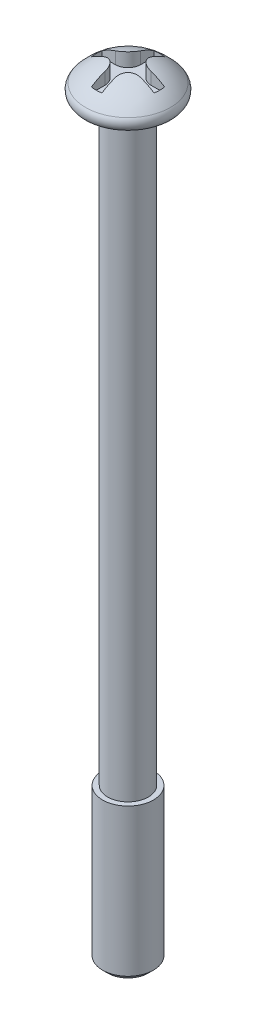
ISO-10303-21;
HEADER;
FILE_DESCRIPTION(('STEP AP214'),'2;1');
FILE_NAME('part.step','',(''),(''),'','','');
FILE_SCHEMA(('AUTOMOTIVE_DESIGN { 1 0 10303 214 1 1 1 1 }'));
ENDSEC;
DATA;
#1=APPLICATION_CONTEXT('core data for automotive mechanical design processes');
#2=APPLICATION_PROTOCOL_DEFINITION('international standard','automotive_design',2000,#1);
#3=PRODUCT_CONTEXT('',#1,'mechanical');
#4=PRODUCT('Part','Part','',(#3));
#5=PRODUCT_RELATED_PRODUCT_CATEGORY('part','',(#4));
#6=PRODUCT_DEFINITION_FORMATION('','',#4);
#7=PRODUCT_DEFINITION_CONTEXT('part definition',#1,'design');
#8=PRODUCT_DEFINITION('design','',#6,#7);
#9=PRODUCT_DEFINITION_SHAPE('','',#8);
#10=(LENGTH_UNIT() NAMED_UNIT(*) SI_UNIT(.MILLI.,.METRE.));
#11=(NAMED_UNIT(*) PLANE_ANGLE_UNIT() SI_UNIT($,.RADIAN.));
#12=(NAMED_UNIT(*) SI_UNIT($,.STERADIAN.) SOLID_ANGLE_UNIT());
#13=UNCERTAINTY_MEASURE_WITH_UNIT(LENGTH_MEASURE(1.E-05),#10,'distance_accuracy_value','');
#14=(GEOMETRIC_REPRESENTATION_CONTEXT(3) GLOBAL_UNCERTAINTY_ASSIGNED_CONTEXT((#13)) GLOBAL_UNIT_ASSIGNED_CONTEXT((#10,
#11,#12)) REPRESENTATION_CONTEXT('',''));
#15=CARTESIAN_POINT('',(0.,0.,0.));
#16=DIRECTION('',(0.,0.,1.));
#17=DIRECTION('',(1.,0.,0.));
#18=AXIS2_PLACEMENT_3D('',#15,#16,#17);
#19=CARTESIAN_POINT('',(0.,0.6,0.));
#20=DIRECTION('',(0.,-1.,0.));
#21=DIRECTION('',(0.,0.,-1.));
#22=AXIS2_PLACEMENT_3D('',#19,#20,#21);
#23=PLANE('',#22);
#24=DIRECTION('',(0.,0.,1.));
#25=VECTOR('',#24,1.);
#26=CARTESIAN_POINT('',(-0.2071067811865,0.6,1.232723318992));
#27=LINE('',#26,#25);
#28=CARTESIAN_POINT('',(-0.2071067811865,0.6,0.7071067811865));
#29=VERTEX_POINT('',#28);
#30=CARTESIAN_POINT('',(-0.2071067811865,0.6,1.23272331899198));
#31=VERTEX_POINT('',#30);
#32=EDGE_CURVE('E160',#29,#31,#27,.T.);
#33=ORIENTED_EDGE('',*,*,#32,.T.);
#34=CARTESIAN_POINT('',(0.,0.6,0.));
#35=DIRECTION('',(0.,-1.,0.));
#36=DIRECTION('',(0.,0.,-1.));
#37=AXIS2_PLACEMENT_3D('',#34,#35,#36);
#38=CIRCLE('',#37,1.25);
#39=CARTESIAN_POINT('',(0.207106781186497,0.6,1.23272331899197));
#40=VERTEX_POINT('',#39);
#41=EDGE_CURVE('E244',#31,#40,#38,.F.);
#42=ORIENTED_EDGE('',*,*,#41,.T.);
#43=DIRECTION('',(0.,0.,-1.));
#44=VECTOR('',#43,1.);
#45=CARTESIAN_POINT('',(0.2071067811865,0.6,0.7071067811865));
#46=LINE('',#45,#44);
#47=CARTESIAN_POINT('',(0.2071067811865,0.6,0.7071067811865));
#48=VERTEX_POINT('',#47);
#49=EDGE_CURVE('E164',#40,#48,#46,.T.);
#50=ORIENTED_EDGE('',*,*,#49,.T.);
#51=CARTESIAN_POINT('',(0.7071067811865,0.6,0.7071067811865));
#52=DIRECTION('',(0.,-1.,0.));
#53=DIRECTION('',(0.,0.,-1.));
#54=AXIS2_PLACEMENT_3D('',#51,#52,#53);
#55=CIRCLE('',#54,0.5);
#56=CARTESIAN_POINT('',(0.7071067811865,0.6,0.2071067811865));
#57=VERTEX_POINT('',#56);
#58=EDGE_CURVE('E167',#57,#48,#55,.F.);
#59=ORIENTED_EDGE('',*,*,#58,.F.);
#60=DIRECTION('',(1.,0.,0.));
#61=VECTOR('',#60,1.);
#62=CARTESIAN_POINT('',(1.232723318992,0.6,0.2071067811865));
#63=LINE('',#62,#61);
#64=CARTESIAN_POINT('',(1.23272331899198,0.6,0.2071067811865));
#65=VERTEX_POINT('',#64);
#66=EDGE_CURVE('E168',#57,#65,#63,.T.);
#67=ORIENTED_EDGE('',*,*,#66,.T.);
#68=CARTESIAN_POINT('',(0.,0.6,0.));
#69=DIRECTION('',(0.,-1.,0.));
#70=DIRECTION('',(0.,0.,-1.));
#71=AXIS2_PLACEMENT_3D('',#68,#69,#70);
#72=CIRCLE('',#71,1.25);
#73=CARTESIAN_POINT('',(1.23272331899197,0.6,-0.207106781186497));
#74=VERTEX_POINT('',#73);
#75=EDGE_CURVE('E255',#65,#74,#72,.F.);
#76=ORIENTED_EDGE('',*,*,#75,.T.);
#77=DIRECTION('',(-1.,0.,0.));
#78=VECTOR('',#77,1.);
#79=CARTESIAN_POINT('',(0.7071067811865,0.6,-0.2071067811865));
#80=LINE('',#79,#78);
#81=CARTESIAN_POINT('',(0.7071067811865,0.6,-0.2071067811865));
#82=VERTEX_POINT('',#81);
#83=EDGE_CURVE('E173',#74,#82,#80,.T.);
#84=ORIENTED_EDGE('',*,*,#83,.T.);
#85=CARTESIAN_POINT('',(0.7071067811865,0.6,-0.7071067811865));
#86=DIRECTION('',(0.,-1.,0.));
#87=DIRECTION('',(0.,0.,-1.));
#88=AXIS2_PLACEMENT_3D('',#85,#86,#87);
#89=CIRCLE('',#88,0.5);
#90=CARTESIAN_POINT('',(0.2071067811865,0.6,-0.7071067811865));
#91=VERTEX_POINT('',#90);
#92=EDGE_CURVE('E176',#91,#82,#89,.F.);
#93=ORIENTED_EDGE('',*,*,#92,.F.);
#94=DIRECTION('',(0.,0.,-1.));
#95=VECTOR('',#94,1.);
#96=CARTESIAN_POINT('',(0.2071067811865,0.6,-1.232723318992));
#97=LINE('',#96,#95);
#98=CARTESIAN_POINT('',(0.2071067811865,0.6,-1.23272331899198));
#99=VERTEX_POINT('',#98);
#100=EDGE_CURVE('E178',#91,#99,#97,.T.);
#101=ORIENTED_EDGE('',*,*,#100,.T.);
#102=CARTESIAN_POINT('',(0.,0.6,0.));
#103=DIRECTION('',(0.,-1.,0.));
#104=DIRECTION('',(0.,0.,-1.));
#105=AXIS2_PLACEMENT_3D('',#102,#103,#104);
#106=CIRCLE('',#105,1.25);
#107=CARTESIAN_POINT('',(-0.207106781186498,0.6,-1.23272331899197));
#108=VERTEX_POINT('',#107);
#109=EDGE_CURVE('E136',#99,#108,#106,.F.);
#110=ORIENTED_EDGE('',*,*,#109,.T.);
#111=DIRECTION('',(0.,0.,1.));
#112=VECTOR('',#111,1.);
#113=CARTESIAN_POINT('',(-0.2071067811865,0.6,-0.7071067811865));
#114=LINE('',#113,#112);
#115=CARTESIAN_POINT('',(-0.2071067811865,0.6,-0.7071067811865));
#116=VERTEX_POINT('',#115);
#117=EDGE_CURVE('E132',#108,#116,#114,.T.);
#118=ORIENTED_EDGE('',*,*,#117,.T.);
#119=CARTESIAN_POINT('',(-0.7071067811865,0.6,-0.7071067811865));
#120=DIRECTION('',(0.,-1.,0.));
#121=DIRECTION('',(0.,0.,-1.));
#122=AXIS2_PLACEMENT_3D('',#119,#120,#121);
#123=CIRCLE('',#122,0.5);
#124=CARTESIAN_POINT('',(-0.7071067811865,0.6,-0.2071067811865));
#125=VERTEX_POINT('',#124);
#126=EDGE_CURVE('E19',#125,#116,#123,.F.);
#127=ORIENTED_EDGE('',*,*,#126,.F.);
#128=DIRECTION('',(-1.,0.,0.));
#129=VECTOR('',#128,1.);
#130=CARTESIAN_POINT('',(-1.232723318992,0.6,-0.2071067811865));
#131=LINE('',#130,#129);
#132=CARTESIAN_POINT('',(-1.23272331899197,0.6,-0.207106781186497));
#133=VERTEX_POINT('',#132);
#134=EDGE_CURVE('E127',#125,#133,#131,.T.);
#135=ORIENTED_EDGE('',*,*,#134,.T.);
#136=CARTESIAN_POINT('',(0.,0.6,0.));
#137=DIRECTION('',(0.,-1.,0.));
#138=DIRECTION('',(0.,0.,-1.));
#139=AXIS2_PLACEMENT_3D('',#136,#137,#138);
#140=CIRCLE('',#139,1.25);
#141=CARTESIAN_POINT('',(-1.23272331899198,0.6,0.2071067811865));
#142=VERTEX_POINT('',#141);
#143=EDGE_CURVE('E252',#133,#142,#140,.F.);
#144=ORIENTED_EDGE('',*,*,#143,.T.);
#145=DIRECTION('',(1.,0.,0.));
#146=VECTOR('',#145,1.);
#147=CARTESIAN_POINT('',(-0.7071067811865,0.6,0.2071067811865));
#148=LINE('',#147,#146);
#149=CARTESIAN_POINT('',(-0.7071067811865,0.6,0.2071067811865));
#150=VERTEX_POINT('',#149);
#151=EDGE_CURVE('E157',#142,#150,#148,.T.);
#152=ORIENTED_EDGE('',*,*,#151,.T.);
#153=CARTESIAN_POINT('',(-0.7071067811865,0.6,0.7071067811865));
#154=DIRECTION('',(0.,-1.,0.));
#155=DIRECTION('',(0.,0.,-1.));
#156=AXIS2_PLACEMENT_3D('',#153,#154,#155);
#157=CIRCLE('',#156,0.5);
#158=EDGE_CURVE('E238',#29,#150,#157,.F.);
#159=ORIENTED_EDGE('',*,*,#158,.F.);
#160=EDGE_LOOP('',(#33,#42,#50,#59,#67,#76,#84,#93,#101,#110,#118,#127,#135,#144,#152,#159));
#161=FACE_BOUND('',#160,.T.);
#162=ADVANCED_FACE('F16',(#161),#23,.F.);
#163=CARTESIAN_POINT('',(0.,-29.5,0.));
#164=DIRECTION('',(0.,-1.,0.));
#165=DIRECTION('',(0.,0.,-1.));
#166=AXIS2_PLACEMENT_3D('',#163,#164,#165);
#167=PLANE('',#166);
#168=CARTESIAN_POINT('',(0.,-29.4999999999845,0.));
#169=DIRECTION('',(0.,1.,0.));
#170=DIRECTION('',(0.,0.,1.));
#171=AXIS2_PLACEMENT_3D('',#168,#169,#170);
#172=CIRCLE('',#171,0.800000000026557);
#173=CARTESIAN_POINT('',(0.,-29.4999999999845,0.800000000026557));
#174=VERTEX_POINT('',#173);
#175=EDGE_CURVE('E235',#174,#174,#172,.T.);
#176=ORIENTED_EDGE('',*,*,#175,.F.);
#177=EDGE_LOOP('',(#176));
#178=FACE_BOUND('',#177,.T.);
#179=ADVANCED_FACE('F301',(#178),#167,.T.);
#180=CARTESIAN_POINT('',(-1.232723318992,0.6,-0.2071067811865));
#181=DIRECTION('',(0.,0.,-1.));
#182=DIRECTION('',(-1.,0.,0.));
#183=AXIS2_PLACEMENT_3D('',#180,#181,#182);
#184=PLANE('',#183);
#185=ORIENTED_EDGE('',*,*,#134,.F.);
#186=DIRECTION('',(0.,-1.,0.));
#187=VECTOR('',#186,1.);
#188=CARTESIAN_POINT('',(-0.7071067811865,0.6,-0.2071067811865));
#189=LINE('',#188,#187);
#190=CARTESIAN_POINT('',(-0.707106781186498,1.072946400944,-0.2071067811865));
#191=VERTEX_POINT('',#190);
#192=EDGE_CURVE('E146',#191,#125,#189,.T.);
#193=ORIENTED_EDGE('',*,*,#192,.F.);
#194=CARTESIAN_POINT('',(-1.23272331899196,0.810386699023168,-0.2071067811865));
#195=CARTESIAN_POINT('',(-1.20557091875396,0.82887587654213,-0.2071067811865));
#196=CARTESIAN_POINT('',(-1.17800202853966,0.846753291703225,-0.2071067811865));
#197=CARTESIAN_POINT('',(-1.12220017955182,0.881181384346634,-0.2071067811865));
#198=CARTESIAN_POINT('',(-1.09397031989606,0.897737085070877,-0.2071067811865));
#199=CARTESIAN_POINT('',(-1.03685453980652,0.92953512182929,-0.2071067811865));
#200=CARTESIAN_POINT('',(-1.00797004904037,0.944780025871327,-0.2071067811865));
#201=CARTESIAN_POINT('',(-0.949548383728813,0.973963230596895,-0.2071067811865));
#202=CARTESIAN_POINT('',(-0.920011209183401,0.987901531280427,-0.2071067811865));
#203=CARTESIAN_POINT('',(-0.860283187710455,1.01447013922012,-0.2071067811865));
#204=CARTESIAN_POINT('',(-0.830091146209189,1.02709776103264,-0.2071067811865));
#205=CARTESIAN_POINT('',(-0.769049428807063,1.0510361956123,-0.2071067811865));
#206=CARTESIAN_POINT('',(-0.738197597941195,1.06234151350761,-0.2071067811865));
#207=CARTESIAN_POINT('',(-0.707106781186496,1.07294640094399,-0.2071067811865));
#208=B_SPLINE_CURVE_WITH_KNOTS('',3,(#194,#195,#196,#197,#198,#199,#200,#201,#202,#203,#204,
#205,#206,#207),.UNSPECIFIED.,.F.,.F.,(4,2,2,2,2,2,4),(0.,0.0985406624340739,0.196686968259895,
0.29463639109811,0.392585813936324,0.490732119762145,0.589272782196219),.UNSPECIFIED.);
#209=CARTESIAN_POINT('',(-1.23272331899197,0.810386699023184,-0.207106781186497));
#210=VERTEX_POINT('',#209);
#211=EDGE_CURVE('E287',#210,#191,#208,.T.);
#212=ORIENTED_EDGE('',*,*,#211,.F.);
#213=DIRECTION('',(0.,-1.,0.));
#214=VECTOR('',#213,1.);
#215=CARTESIAN_POINT('',(-1.23272331899197,0.6,-0.207106781186494));
#216=LINE('',#215,#214);
#217=EDGE_CURVE('E250',#210,#133,#216,.T.);
#218=ORIENTED_EDGE('',*,*,#217,.T.);
#219=EDGE_LOOP('',(#185,#193,#212,#218));
#220=FACE_BOUND('',#219,.T.);
#221=ADVANCED_FACE('F297',(#220),#184,.F.);
#222=CARTESIAN_POINT('',(-0.7071067811865,0.6,-0.7071067811865));
#223=DIRECTION('',(0.,-1.,0.));
#224=DIRECTION('',(0.,0.,-1.));
#225=AXIS2_PLACEMENT_3D('',#222,#223,#224);
#226=CYLINDRICAL_SURFACE('',#225,0.5);
#227=DIRECTION('',(0.,1.,0.));
#228=VECTOR('',#227,1.);
#229=CARTESIAN_POINT('',(-0.2071067811865,0.6,-0.7071067811865));
#230=LINE('',#229,#228);
#231=CARTESIAN_POINT('',(-0.2071067811865,1.07294640094399,-0.7071067811865));
#232=VERTEX_POINT('',#231);
#233=EDGE_CURVE('E140',#116,#232,#230,.T.);
#234=ORIENTED_EDGE('',*,*,#233,.T.);
#235=CARTESIAN_POINT('',(-0.707106781186496,1.07294640094399,-0.2071067811865));
#236=CARTESIAN_POINT('',(-0.681032109450156,1.08184936360615,-0.207081070804154));
#237=CARTESIAN_POINT('',(-0.654692789517907,1.09007217090469,-0.209146462423067));
#238=CARTESIAN_POINT('',(-0.602189232256978,1.10494894996213,-0.217521272326538));
#239=CARTESIAN_POINT('',(-0.576025489745097,1.11159952945094,-0.223839756253361));
#240=CARTESIAN_POINT('',(-0.524628426984167,1.12309832810892,-0.240805293811514));
#241=CARTESIAN_POINT('',(-0.499397716757144,1.12794179197718,-0.251463615613742));
#242=CARTESIAN_POINT('',(-0.450815555702145,1.13561433951421,-0.27691489764956));
#243=CARTESIAN_POINT('',(-0.42746171658236,1.13844602033163,-0.291702492619723));
#244=CARTESIAN_POINT('',(-0.384547250326186,1.14189822875947,-0.324168044392469));
#245=CARTESIAN_POINT('',(-0.364853574984726,1.14262462173255,-0.341659072391159));
#246=CARTESIAN_POINT('',(-0.328471063683956,1.14214199428963,-0.379503871531294));
#247=CARTESIAN_POINT('',(-0.311781927814025,1.14093316716497,-0.399857356583008));
#248=CARTESIAN_POINT('',(-0.282299252442733,1.1366874239885,-0.442181931986336));
#249=CARTESIAN_POINT('',(-0.269409322094451,1.13370289745833,-0.464091400572117));
#250=CARTESIAN_POINT('',(-0.247169371381563,1.12605008214753,-0.50938228019127));
#251=CARTESIAN_POINT('',(-0.237822286057971,1.1213804035403,-0.532764893020356));
#252=CARTESIAN_POINT('',(-0.222515268127987,1.11029409519183,-0.581246396907824));
#253=CARTESIAN_POINT('',(-0.216699862381791,1.10381703937803,-0.606376700234224));
#254=CARTESIAN_POINT('',(-0.208987376830147,1.08941617116049,-0.656788214834921));
#255=CARTESIAN_POINT('',(-0.207084783049661,1.0814944118223,-0.682069163327835));
#256=CARTESIAN_POINT('',(-0.2071067811865,1.07294640094399,-0.707106781186496));
#257=B_SPLINE_CURVE_WITH_KNOTS('',3,(#235,#236,#237,#238,#239,#240,#241,#242,#243,#244,#245,
#246,#247,#248,#249,#250,#251,#252,#253,#254,#255,#256),.UNSPECIFIED.,.F.,.F.,(4,2,2,2,2,2,2,2,
2,2,4),(0.,0.0826173206247365,0.165411303498771,0.248421641687185,0.331324620447903,
0.409979626547998,0.488626777012635,0.565061216509943,0.641558839808856,0.721006589793719,
0.800342304257926),.UNSPECIFIED.);
#258=EDGE_CURVE('E277',#191,#232,#257,.T.);
#259=ORIENTED_EDGE('',*,*,#258,.F.);
#260=ORIENTED_EDGE('',*,*,#192,.T.);
#261=ORIENTED_EDGE('',*,*,#126,.T.);
#262=EDGE_LOOP('',(#234,#259,#260,#261));
#263=FACE_BOUND('',#262,.T.);
#264=ADVANCED_FACE('F143',(#263),#226,.T.);
#265=CARTESIAN_POINT('',(-0.2071067811865,0.6,-0.7071067811865));
#266=DIRECTION('',(-1.,0.,0.));
#267=DIRECTION('',(0.,0.,1.));
#268=AXIS2_PLACEMENT_3D('',#265,#266,#267);
#269=PLANE('',#268);
#270=ORIENTED_EDGE('',*,*,#117,.F.);
#271=DIRECTION('',(0.,-1.,0.));
#272=VECTOR('',#271,1.);
#273=CARTESIAN_POINT('',(-0.207106781186495,0.6,-1.23272331899197));
#274=LINE('',#273,#272);
#275=CARTESIAN_POINT('',(-0.2071067811865,0.810386699023183,-1.23272331899195));
#276=VERTEX_POINT('',#275);
#277=EDGE_CURVE('E152',#108,#276,#274,.F.);
#278=ORIENTED_EDGE('',*,*,#277,.T.);
#279=CARTESIAN_POINT('',(-0.2071067811865,-1.,0.));
#280=DIRECTION('',(-1.,0.,0.));
#281=DIRECTION('',(0.,0.,1.));
#282=AXIS2_PLACEMENT_3D('',#279,#280,#281);
#283=CIRCLE('',#282,2.19022984665687);
#284=EDGE_CURVE('E149',#232,#276,#283,.T.);
#285=ORIENTED_EDGE('',*,*,#284,.F.);
#286=ORIENTED_EDGE('',*,*,#233,.F.);
#287=EDGE_LOOP('',(#270,#278,#285,#286));
#288=FACE_BOUND('',#287,.T.);
#289=ADVANCED_FACE('F147',(#288),#269,.F.);
#290=CARTESIAN_POINT('',(0.,0.6,0.));
#291=DIRECTION('',(0.,-1.,0.));
#292=DIRECTION('',(0.,0.,-1.));
#293=AXIS2_PLACEMENT_3D('',#290,#291,#292);
#294=CYLINDRICAL_SURFACE('',#293,1.25);
#295=ORIENTED_EDGE('',*,*,#109,.F.);
#296=DIRECTION('',(0.,1.,0.));
#297=VECTOR('',#296,1.);
#298=CARTESIAN_POINT('',(0.2071067811865,0.6,-1.232723318992));
#299=LINE('',#298,#297);
#300=CARTESIAN_POINT('',(0.2071067811865,0.810386699023172,-1.23272331899197));
#301=VERTEX_POINT('',#300);
#302=EDGE_CURVE('E179',#99,#301,#299,.T.);
#303=ORIENTED_EDGE('',*,*,#302,.T.);
#304=CARTESIAN_POINT('',(0.,0.8103866990232,0.));
#305=DIRECTION('',(0.,-1.,0.));
#306=DIRECTION('',(0.,0.,-1.));
#307=AXIS2_PLACEMENT_3D('',#304,#305,#306);
#308=CIRCLE('',#307,1.25);
#309=EDGE_CURVE('E265',#276,#301,#308,.T.);
#310=ORIENTED_EDGE('',*,*,#309,.F.);
#311=ORIENTED_EDGE('',*,*,#277,.F.);
#312=EDGE_LOOP('',(#295,#303,#310,#311));
#313=FACE_BOUND('',#312,.T.);
#314=ADVANCED_FACE('F263',(#313),#294,.F.);
#315=CARTESIAN_POINT('',(0.2071067811865,0.6,-1.232723318992));
#316=DIRECTION('',(1.,0.,0.));
#317=DIRECTION('',(0.,0.,-1.));
#318=AXIS2_PLACEMENT_3D('',#315,#316,#317);
#319=PLANE('',#318);
#320=ORIENTED_EDGE('',*,*,#100,.F.);
#321=DIRECTION('',(0.,-1.,0.));
#322=VECTOR('',#321,1.);
#323=CARTESIAN_POINT('',(0.2071067811865,0.6,-0.7071067811865));
#324=LINE('',#323,#322);
#325=CARTESIAN_POINT('',(0.2071067811865,1.07294640094399,-0.7071067811865));
#326=VERTEX_POINT('',#325);
#327=EDGE_CURVE('E257',#326,#91,#324,.T.);
#328=ORIENTED_EDGE('',*,*,#327,.F.);
#329=CARTESIAN_POINT('',(0.2071067811865,-1.,0.));
#330=DIRECTION('',(-1.,0.,0.));
#331=DIRECTION('',(0.,0.,1.));
#332=AXIS2_PLACEMENT_3D('',#329,#330,#331);
#333=CIRCLE('',#332,2.19022984665687);
#334=EDGE_CURVE('E268',#301,#326,#333,.F.);
#335=ORIENTED_EDGE('',*,*,#334,.F.);
#336=ORIENTED_EDGE('',*,*,#302,.F.);
#337=EDGE_LOOP('',(#320,#328,#335,#336));
#338=FACE_BOUND('',#337,.T.);
#339=ADVANCED_FACE('F269',(#338),#319,.F.);
#340=CARTESIAN_POINT('',(0.7071067811865,0.6,-0.7071067811865));
#341=DIRECTION('',(0.,-1.,0.));
#342=DIRECTION('',(0.,0.,-1.));
#343=AXIS2_PLACEMENT_3D('',#340,#341,#342);
#344=CYLINDRICAL_SURFACE('',#343,0.5);
#345=DIRECTION('',(0.,1.,0.));
#346=VECTOR('',#345,1.);
#347=CARTESIAN_POINT('',(0.7071067811865,0.6,-0.2071067811865));
#348=LINE('',#347,#346);
#349=CARTESIAN_POINT('',(0.707106781186498,1.072946400944,-0.2071067811865));
#350=VERTEX_POINT('',#349);
#351=EDGE_CURVE('E175',#82,#350,#348,.T.);
#352=ORIENTED_EDGE('',*,*,#351,.T.);
#353=CARTESIAN_POINT('',(0.2071067811865,1.07294640094399,-0.707106781186496));
#354=CARTESIAN_POINT('',(0.207081070804154,1.08184936360616,-0.681032109450141));
#355=CARTESIAN_POINT('',(0.209146462423069,1.0900721709047,-0.654692789517877));
#356=CARTESIAN_POINT('',(0.21752127232655,1.10494894996215,-0.602189232256918));
#357=CARTESIAN_POINT('',(0.22383975625338,1.11159952945095,-0.576025489745022));
#358=CARTESIAN_POINT('',(0.240805293811553,1.12309832810894,-0.524628426984064));
#359=CARTESIAN_POINT('',(0.251463615613793,1.1279417919772,-0.499397716757028));
#360=CARTESIAN_POINT('',(0.276914897649641,1.13561433951423,-0.450815555702008));
#361=CARTESIAN_POINT('',(0.291702492619821,1.13844602033164,-0.427461716582213));
#362=CARTESIAN_POINT('',(0.324168044392593,1.14189822875948,-0.384547250326039));
#363=CARTESIAN_POINT('',(0.341659072391289,1.14262462173256,-0.364853574984587));
#364=CARTESIAN_POINT('',(0.379503871531435,1.14214199428962,-0.328471063683833));
#365=CARTESIAN_POINT('',(0.399857356583154,1.14093316716496,-0.311781927813911));
#366=CARTESIAN_POINT('',(0.442181931986491,1.13668742398848,-0.282299252442636));
#367=CARTESIAN_POINT('',(0.464091400572276,1.1337028974583,-0.269409322094362));
#368=CARTESIAN_POINT('',(0.509382280191437,1.1260500821475,-0.247169371381491));
#369=CARTESIAN_POINT('',(0.532764893020525,1.12138040354027,-0.237822286057909));
#370=CARTESIAN_POINT('',(0.581246396907969,1.11029409519179,-0.222515268127952));
#371=CARTESIAN_POINT('',(0.606376700234341,1.103817039378,-0.216699862381768));
#372=CARTESIAN_POINT('',(0.65678821483498,1.08941617116047,-0.208987376830143));
#373=CARTESIAN_POINT('',(0.682069163327864,1.08149441182229,-0.207084783049661));
#374=CARTESIAN_POINT('',(0.707106781186497,1.07294640094399,-0.2071067811865));
#375=B_SPLINE_CURVE_WITH_KNOTS('',3,(#353,#354,#355,#356,#357,#358,#359,#360,#361,#362,#363,
#364,#365,#366,#367,#368,#369,#370,#371,#372,#373,#374),.UNSPECIFIED.,.F.,.F.,(4,2,2,2,2,2,2,2,
2,2,4),(0.,0.0826173206247837,0.165411303498866,0.248421641687329,0.331324620448095,
0.409979626548186,0.488626777012818,0.565061216510127,0.641558839809039,0.721006589793811,
0.800342304257926),.UNSPECIFIED.);
#376=EDGE_CURVE('E273',#326,#350,#375,.T.);
#377=ORIENTED_EDGE('',*,*,#376,.F.);
#378=ORIENTED_EDGE('',*,*,#327,.T.);
#379=ORIENTED_EDGE('',*,*,#92,.T.);
#380=EDGE_LOOP('',(#352,#377,#378,#379));
#381=FACE_BOUND('',#380,.T.);
#382=ADVANCED_FACE('F357',(#381),#344,.T.);
#383=CARTESIAN_POINT('',(0.7071067811865,0.6,-0.2071067811865));
#384=DIRECTION('',(0.,0.,-1.));
#385=DIRECTION('',(-1.,0.,0.));
#386=AXIS2_PLACEMENT_3D('',#383,#384,#385);
#387=PLANE('',#386);
#388=ORIENTED_EDGE('',*,*,#83,.F.);
#389=DIRECTION('',(0.,-1.,0.));
#390=VECTOR('',#389,1.);
#391=CARTESIAN_POINT('',(1.23272331899197,0.6,-0.207106781186495));
#392=LINE('',#391,#390);
#393=CARTESIAN_POINT('',(1.23272331899197,0.8103866990232,-0.207106781186497));
#394=VERTEX_POINT('',#393);
#395=EDGE_CURVE('E172',#74,#394,#392,.F.);
#396=ORIENTED_EDGE('',*,*,#395,.T.);
#397=CARTESIAN_POINT('',(0.707106781186497,1.07294640094399,-0.2071067811865));
#398=CARTESIAN_POINT('',(0.738197597941195,1.06234151350761,-0.2071067811865));
#399=CARTESIAN_POINT('',(0.769049428807063,1.0510361956123,-0.2071067811865));
#400=CARTESIAN_POINT('',(0.830091146209189,1.02709776103264,-0.2071067811865));
#401=CARTESIAN_POINT('',(0.860283187710455,1.01447013922012,-0.2071067811865));
#402=CARTESIAN_POINT('',(0.920011209183402,0.987901531280427,-0.2071067811865));
#403=CARTESIAN_POINT('',(0.949548383728813,0.973963230596895,-0.2071067811865));
#404=CARTESIAN_POINT('',(1.00797004904037,0.944780025871326,-0.2071067811865));
#405=CARTESIAN_POINT('',(1.03685453980652,0.92953512182929,-0.2071067811865));
#406=CARTESIAN_POINT('',(1.09397031989606,0.897737085070877,-0.2071067811865));
#407=CARTESIAN_POINT('',(1.12220017955182,0.881181384346634,-0.2071067811865));
#408=CARTESIAN_POINT('',(1.17800202853966,0.846753291703224,-0.2071067811865));
#409=CARTESIAN_POINT('',(1.20557091875396,0.82887587654213,-0.2071067811865));
#410=CARTESIAN_POINT('',(1.23272331899196,0.810386699023168,-0.207106781186499));
#411=B_SPLINE_CURVE_WITH_KNOTS('',3,(#397,#398,#399,#400,#401,#402,#403,#404,#405,#406,#407,
#408,#409,#410),.UNSPECIFIED.,.F.,.F.,(4,2,2,2,2,2,4),(0.,0.0985406624340736,0.196686968259895,
0.294636391098109,0.392585813936324,0.490732119762145,0.589272782196219),.UNSPECIFIED.);
#412=EDGE_CURVE('E364',#350,#394,#411,.T.);
#413=ORIENTED_EDGE('',*,*,#412,.F.);
#414=ORIENTED_EDGE('',*,*,#351,.F.);
#415=EDGE_LOOP('',(#388,#396,#413,#414));
#416=FACE_BOUND('',#415,.T.);
#417=ADVANCED_FACE('F361',(#416),#387,.F.);
#418=CARTESIAN_POINT('',(0.,0.6,0.));
#419=DIRECTION('',(0.,-1.,0.));
#420=DIRECTION('',(0.,0.,-1.));
#421=AXIS2_PLACEMENT_3D('',#418,#419,#420);
#422=CYLINDRICAL_SURFACE('',#421,1.25);
#423=ORIENTED_EDGE('',*,*,#143,.F.);
#424=ORIENTED_EDGE('',*,*,#217,.F.);
#425=CARTESIAN_POINT('',(0.,0.8103866990232,0.));
#426=DIRECTION('',(0.,-1.,0.));
#427=DIRECTION('',(0.,0.,-1.));
#428=AXIS2_PLACEMENT_3D('',#425,#426,#427);
#429=CIRCLE('',#428,1.25);
#430=CARTESIAN_POINT('',(-1.23272331899198,0.8103866990232,0.2071067811865));
#431=VERTEX_POINT('',#430);
#432=EDGE_CURVE('E366',#431,#210,#429,.T.);
#433=ORIENTED_EDGE('',*,*,#432,.F.);
#434=DIRECTION('',(0.,1.,0.));
#435=VECTOR('',#434,1.);
#436=CARTESIAN_POINT('',(-1.232723318992,0.6,0.2071067811865));
#437=LINE('',#436,#435);
#438=EDGE_CURVE('E159',#431,#142,#437,.F.);
#439=ORIENTED_EDGE('',*,*,#438,.T.);
#440=EDGE_LOOP('',(#423,#424,#433,#439));
#441=FACE_BOUND('',#440,.T.);
#442=ADVANCED_FACE('F444',(#441),#422,.F.);
#443=CARTESIAN_POINT('',(0.,0.6,0.));
#444=DIRECTION('',(0.,-1.,0.));
#445=DIRECTION('',(0.,0.,-1.));
#446=AXIS2_PLACEMENT_3D('',#443,#444,#445);
#447=CYLINDRICAL_SURFACE('',#446,1.25);
#448=ORIENTED_EDGE('',*,*,#395,.F.);
#449=ORIENTED_EDGE('',*,*,#75,.F.);
#450=DIRECTION('',(0.,1.,0.));
#451=VECTOR('',#450,1.);
#452=CARTESIAN_POINT('',(1.232723318992,0.6,0.2071067811865));
#453=LINE('',#452,#451);
#454=CARTESIAN_POINT('',(1.23272331899198,0.810386699023182,0.2071067811865));
#455=VERTEX_POINT('',#454);
#456=EDGE_CURVE('E171',#65,#455,#453,.T.);
#457=ORIENTED_EDGE('',*,*,#456,.T.);
#458=CARTESIAN_POINT('',(0.,0.8103866990232,0.));
#459=DIRECTION('',(0.,-1.,0.));
#460=DIRECTION('',(0.,0.,-1.));
#461=AXIS2_PLACEMENT_3D('',#458,#459,#460);
#462=CIRCLE('',#461,1.25);
#463=EDGE_CURVE('E593',#394,#455,#462,.T.);
#464=ORIENTED_EDGE('',*,*,#463,.F.);
#465=EDGE_LOOP('',(#448,#449,#457,#464));
#466=FACE_BOUND('',#465,.T.);
#467=ADVANCED_FACE('F451',(#466),#447,.F.);
#468=CARTESIAN_POINT('',(1.232723318992,0.6,0.2071067811865));
#469=DIRECTION('',(0.,0.,1.));
#470=DIRECTION('',(1.,0.,0.));
#471=AXIS2_PLACEMENT_3D('',#468,#469,#470);
#472=PLANE('',#471);
#473=ORIENTED_EDGE('',*,*,#66,.F.);
#474=DIRECTION('',(0.,-1.,0.));
#475=VECTOR('',#474,1.);
#476=CARTESIAN_POINT('',(0.7071067811865,0.6,0.2071067811865));
#477=LINE('',#476,#475);
#478=CARTESIAN_POINT('',(0.707106781186498,1.072946400944,0.2071067811865));
#479=VERTEX_POINT('',#478);
#480=EDGE_CURVE('E246',#479,#57,#477,.T.);
#481=ORIENTED_EDGE('',*,*,#480,.F.);
#482=CARTESIAN_POINT('',(1.23272331899197,0.810386699023165,0.2071067811865));
#483=CARTESIAN_POINT('',(1.20557091875396,0.828875876542126,0.2071067811865));
#484=CARTESIAN_POINT('',(1.17800202853966,0.846753291703221,0.2071067811865));
#485=CARTESIAN_POINT('',(1.12220017955182,0.881181384346632,0.2071067811865));
#486=CARTESIAN_POINT('',(1.09397031989606,0.897737085070875,0.2071067811865));
#487=CARTESIAN_POINT('',(1.03685453980653,0.929535121829288,0.2071067811865));
#488=CARTESIAN_POINT('',(1.00797004904038,0.944780025871325,0.2071067811865));
#489=CARTESIAN_POINT('',(0.949548383728815,0.973963230596894,0.2071067811865));
#490=CARTESIAN_POINT('',(0.920011209183404,0.987901531280426,0.2071067811865));
#491=CARTESIAN_POINT('',(0.860283187710457,1.01447013922012,0.2071067811865));
#492=CARTESIAN_POINT('',(0.83009114620919,1.02709776103264,0.2071067811865));
#493=CARTESIAN_POINT('',(0.769049428807064,1.0510361956123,0.2071067811865));
#494=CARTESIAN_POINT('',(0.738197597941195,1.06234151350761,0.2071067811865));
#495=CARTESIAN_POINT('',(0.707106781186496,1.07294640094399,0.207106781186501));
#496=B_SPLINE_CURVE_WITH_KNOTS('',3,(#482,#483,#484,#485,#486,#487,#488,#489,#490,#491,#492,
#493,#494,#495),.UNSPECIFIED.,.F.,.F.,(4,2,2,2,2,2,4),(0.,0.0985406624340749,0.196686968259897,
0.294636391098113,0.392585813936328,0.49073211976215,0.589272782196225),.UNSPECIFIED.);
#497=EDGE_CURVE('E592',#455,#479,#496,.T.);
#498=ORIENTED_EDGE('',*,*,#497,.F.);
#499=ORIENTED_EDGE('',*,*,#456,.F.);
#500=EDGE_LOOP('',(#473,#481,#498,#499));
#501=FACE_BOUND('',#500,.T.);
#502=ADVANCED_FACE('F459',(#501),#472,.F.);
#503=CARTESIAN_POINT('',(0.7071067811865,0.6,0.7071067811865));
#504=DIRECTION('',(0.,-1.,0.));
#505=DIRECTION('',(0.,0.,-1.));
#506=AXIS2_PLACEMENT_3D('',#503,#504,#505);
#507=CYLINDRICAL_SURFACE('',#506,0.5);
#508=DIRECTION('',(0.,1.,0.));
#509=VECTOR('',#508,1.);
#510=CARTESIAN_POINT('',(0.2071067811865,0.6,0.7071067811865));
#511=LINE('',#510,#509);
#512=CARTESIAN_POINT('',(0.2071067811865,1.07294640094399,0.707106781186498));
#513=VERTEX_POINT('',#512);
#514=EDGE_CURVE('E166',#48,#513,#511,.T.);
#515=ORIENTED_EDGE('',*,*,#514,.T.);
#516=CARTESIAN_POINT('',(0.707106781186496,1.07294640094399,0.2071067811865));
#517=CARTESIAN_POINT('',(0.681032109450157,1.08184936360615,0.207081070804154));
#518=CARTESIAN_POINT('',(0.654692789517907,1.09007217090469,0.209146462423067));
#519=CARTESIAN_POINT('',(0.602189232256979,1.10494894996213,0.217521272326537));
#520=CARTESIAN_POINT('',(0.576025489745098,1.11159952945094,0.22383975625336));
#521=CARTESIAN_POINT('',(0.524628426984168,1.12309832810892,0.240805293811513));
#522=CARTESIAN_POINT('',(0.499397716757145,1.12794179197718,0.251463615613741));
#523=CARTESIAN_POINT('',(0.450815555702147,1.13561433951421,0.276914897649559));
#524=CARTESIAN_POINT('',(0.427461716582363,1.13844602033163,0.291702492619723));
#525=CARTESIAN_POINT('',(0.384547250326188,1.14189822875948,0.324168044392469));
#526=CARTESIAN_POINT('',(0.364853574984728,1.14262462173255,0.341659072391157));
#527=CARTESIAN_POINT('',(0.328471063683957,1.14214199428963,0.379503871531292));
#528=CARTESIAN_POINT('',(0.311781927814027,1.14093316716497,0.399857356583006));
#529=CARTESIAN_POINT('',(0.282299252442735,1.1366874239885,0.442181931986334));
#530=CARTESIAN_POINT('',(0.269409322094453,1.13370289745833,0.464091400572114));
#531=CARTESIAN_POINT('',(0.247169371381564,1.12605008214753,0.509382280191267));
#532=CARTESIAN_POINT('',(0.237822286057972,1.12138040354031,0.532764893020352));
#533=CARTESIAN_POINT('',(0.222515268127988,1.11029409519183,0.581246396907821));
#534=CARTESIAN_POINT('',(0.216699862381791,1.10381703937803,0.606376700234222));
#535=CARTESIAN_POINT('',(0.208987376830147,1.08941617116049,0.65678821483492));
#536=CARTESIAN_POINT('',(0.207084783049661,1.0814944118223,0.682069163327835));
#537=CARTESIAN_POINT('',(0.207106781186501,1.07294640094399,0.707106781186497));
#538=B_SPLINE_CURVE_WITH_KNOTS('',3,(#516,#517,#518,#519,#520,#521,#522,#523,#524,#525,#526,
#527,#528,#529,#530,#531,#532,#533,#534,#535,#536,#537),.UNSPECIFIED.,.F.,.F.,(4,2,2,2,2,2,2,2,
2,2,4),(0.,0.082617320624736,0.16541130349877,0.248421641687183,0.331324620447901,
0.409979626547996,0.488626777012632,0.56506121650994,0.641558839808852,0.721006589793717,
0.800342304257927),.UNSPECIFIED.);
#539=EDGE_CURVE('E588',#479,#513,#538,.T.);
#540=ORIENTED_EDGE('',*,*,#539,.F.);
#541=ORIENTED_EDGE('',*,*,#480,.T.);
#542=ORIENTED_EDGE('',*,*,#58,.T.);
#543=EDGE_LOOP('',(#515,#540,#541,#542));
#544=FACE_BOUND('',#543,.T.);
#545=ADVANCED_FACE('F468',(#544),#507,.T.);
#546=CARTESIAN_POINT('',(0.2071067811865,0.6,0.7071067811865));
#547=DIRECTION('',(1.,0.,0.));
#548=DIRECTION('',(0.,0.,-1.));
#549=AXIS2_PLACEMENT_3D('',#546,#547,#548);
#550=PLANE('',#549);
#551=ORIENTED_EDGE('',*,*,#49,.F.);
#552=DIRECTION('',(0.,-1.,0.));
#553=VECTOR('',#552,1.);
#554=CARTESIAN_POINT('',(0.207106781186494,0.6,1.23272331899197));
#555=LINE('',#554,#553);
#556=CARTESIAN_POINT('',(0.207106781186497,0.8103866990232,1.23272331899197));
#557=VERTEX_POINT('',#556);
#558=EDGE_CURVE('E163',#40,#557,#555,.F.);
#559=ORIENTED_EDGE('',*,*,#558,.T.);
#560=CARTESIAN_POINT('',(0.207106781186499,1.07294640094399,0.707106781186497));
#561=CARTESIAN_POINT('',(0.2071067811865,1.06234151350761,0.738197597941195));
#562=CARTESIAN_POINT('',(0.2071067811865,1.0510361956123,0.769049428807063));
#563=CARTESIAN_POINT('',(0.2071067811865,1.02709776103264,0.830091146209189));
#564=CARTESIAN_POINT('',(0.2071067811865,1.01447013922012,0.860283187710455));
#565=CARTESIAN_POINT('',(0.2071067811865,0.987901531280426,0.920011209183402));
#566=CARTESIAN_POINT('',(0.2071067811865,0.973963230596895,0.949548383728813));
#567=CARTESIAN_POINT('',(0.2071067811865,0.944780025871327,1.00797004904037));
#568=CARTESIAN_POINT('',(0.2071067811865,0.92953512182929,1.03685453980652));
#569=CARTESIAN_POINT('',(0.2071067811865,0.897737085070877,1.09397031989606));
#570=CARTESIAN_POINT('',(0.2071067811865,0.881181384346634,1.12220017955182));
#571=CARTESIAN_POINT('',(0.2071067811865,0.846753291703224,1.17800202853966));
#572=CARTESIAN_POINT('',(0.2071067811865,0.828875876542129,1.20557091875396));
#573=CARTESIAN_POINT('',(0.2071067811865,0.810386699023168,1.23272331899196));
#574=B_SPLINE_CURVE_WITH_KNOTS('',3,(#560,#561,#562,#563,#564,#565,#566,#567,#568,#569,#570,
#571,#572,#573),.UNSPECIFIED.,.F.,.F.,(4,2,2,2,2,2,4),(0.,0.0985406624340738,0.196686968259895,
0.29463639109811,0.392585813936324,0.490732119762146,0.589272782196219),.UNSPECIFIED.);
#575=EDGE_CURVE('E584',#513,#557,#574,.T.);
#576=ORIENTED_EDGE('',*,*,#575,.F.);
#577=ORIENTED_EDGE('',*,*,#514,.F.);
#578=EDGE_LOOP('',(#551,#559,#576,#577));
#579=FACE_BOUND('',#578,.T.);
#580=ADVANCED_FACE('F477',(#579),#550,.F.);
#581=CARTESIAN_POINT('',(0.,0.6,0.));
#582=DIRECTION('',(0.,-1.,0.));
#583=DIRECTION('',(0.,0.,-1.));
#584=AXIS2_PLACEMENT_3D('',#581,#582,#583);
#585=CYLINDRICAL_SURFACE('',#584,1.25);
#586=ORIENTED_EDGE('',*,*,#41,.F.);
#587=DIRECTION('',(0.,1.,0.));
#588=VECTOR('',#587,1.);
#589=CARTESIAN_POINT('',(-0.2071067811865,0.6,1.232723318992));
#590=LINE('',#589,#588);
#591=CARTESIAN_POINT('',(-0.2071067811865,0.810386699023182,1.23272331899199));
#592=VERTEX_POINT('',#591);
#593=EDGE_CURVE('E162',#31,#592,#590,.T.);
#594=ORIENTED_EDGE('',*,*,#593,.T.);
#595=CARTESIAN_POINT('',(0.,0.8103866990232,0.));
#596=DIRECTION('',(0.,-1.,0.));
#597=DIRECTION('',(0.,0.,-1.));
#598=AXIS2_PLACEMENT_3D('',#595,#596,#597);
#599=CIRCLE('',#598,1.25);
#600=EDGE_CURVE('E580',#557,#592,#599,.T.);
#601=ORIENTED_EDGE('',*,*,#600,.F.);
#602=ORIENTED_EDGE('',*,*,#558,.F.);
#603=EDGE_LOOP('',(#586,#594,#601,#602));
#604=FACE_BOUND('',#603,.T.);
#605=ADVANCED_FACE('F486',(#604),#585,.F.);
#606=CARTESIAN_POINT('',(-0.2071067811865,0.6,1.232723318992));
#607=DIRECTION('',(-1.,0.,0.));
#608=DIRECTION('',(0.,0.,1.));
#609=AXIS2_PLACEMENT_3D('',#606,#607,#608);
#610=PLANE('',#609);
#611=ORIENTED_EDGE('',*,*,#32,.F.);
#612=DIRECTION('',(0.,-1.,0.));
#613=VECTOR('',#612,1.);
#614=CARTESIAN_POINT('',(-0.2071067811865,0.6,0.7071067811865));
#615=LINE('',#614,#613);
#616=CARTESIAN_POINT('',(-0.2071067811865,1.072946400944,0.707106781186498));
#617=VERTEX_POINT('',#616);
#618=EDGE_CURVE('E239',#617,#29,#615,.T.);
#619=ORIENTED_EDGE('',*,*,#618,.F.);
#620=CARTESIAN_POINT('',(-0.2071067811865,0.810386699023165,1.23272331899197));
#621=CARTESIAN_POINT('',(-0.2071067811865,0.828875876542127,1.20557091875396));
#622=CARTESIAN_POINT('',(-0.2071067811865,0.846753291703222,1.17800202853966));
#623=CARTESIAN_POINT('',(-0.2071067811865,0.881181384346632,1.12220017955182));
#624=CARTESIAN_POINT('',(-0.2071067811865,0.897737085070875,1.09397031989606));
#625=CARTESIAN_POINT('',(-0.2071067811865,0.929535121829289,1.03685453980653));
#626=CARTESIAN_POINT('',(-0.2071067811865,0.944780025871326,1.00797004904038));
#627=CARTESIAN_POINT('',(-0.2071067811865,0.973963230596894,0.949548383728815));
#628=CARTESIAN_POINT('',(-0.2071067811865,0.987901531280426,0.920011209183403));
#629=CARTESIAN_POINT('',(-0.2071067811865,1.01447013922012,0.860283187710456));
#630=CARTESIAN_POINT('',(-0.2071067811865,1.02709776103264,0.83009114620919));
#631=CARTESIAN_POINT('',(-0.2071067811865,1.0510361956123,0.769049428807063));
#632=CARTESIAN_POINT('',(-0.2071067811865,1.06234151350761,0.738197597941195));
#633=CARTESIAN_POINT('',(-0.207106781186501,1.07294640094399,0.707106781186496));
#634=B_SPLINE_CURVE_WITH_KNOTS('',3,(#620,#621,#622,#623,#624,#625,#626,#627,#628,#629,#630,
#631,#632,#633),.UNSPECIFIED.,.F.,.F.,(4,2,2,2,2,2,4),(0.,0.0985406624340749,0.196686968259897,
0.294636391098113,0.392585813936328,0.490732119762151,0.589272782196225),.UNSPECIFIED.);
#635=EDGE_CURVE('E574',#592,#617,#634,.T.);
#636=ORIENTED_EDGE('',*,*,#635,.F.);
#637=ORIENTED_EDGE('',*,*,#593,.F.);
#638=EDGE_LOOP('',(#611,#619,#636,#637));
#639=FACE_BOUND('',#638,.T.);
#640=ADVANCED_FACE('F495',(#639),#610,.F.);
#641=CARTESIAN_POINT('',(-0.7071067811865,0.6,0.7071067811865));
#642=DIRECTION('',(0.,-1.,0.));
#643=DIRECTION('',(0.,0.,-1.));
#644=AXIS2_PLACEMENT_3D('',#641,#642,#643);
#645=CYLINDRICAL_SURFACE('',#644,0.5);
#646=DIRECTION('',(0.,1.,0.));
#647=VECTOR('',#646,1.);
#648=CARTESIAN_POINT('',(-0.7071067811865,0.6,0.2071067811865));
#649=LINE('',#648,#647);
#650=CARTESIAN_POINT('',(-0.707106781186498,1.072946400944,0.2071067811865));
#651=VERTEX_POINT('',#650);
#652=EDGE_CURVE('E34',#150,#651,#649,.T.);
#653=ORIENTED_EDGE('',*,*,#652,.T.);
#654=CARTESIAN_POINT('',(-0.2071067811865,1.07294640094399,0.707106781186497));
#655=CARTESIAN_POINT('',(-0.207081070804153,1.08184936360615,0.681032109450155));
#656=CARTESIAN_POINT('',(-0.209146462423067,1.09007217090469,0.654692789517904));
#657=CARTESIAN_POINT('',(-0.217521272326539,1.10494894996213,0.602189232256971));
#658=CARTESIAN_POINT('',(-0.223839756253363,1.11159952945094,0.576025489745088));
#659=CARTESIAN_POINT('',(-0.240805293811518,1.12309832810892,0.524628426984155));
#660=CARTESIAN_POINT('',(-0.251463615613748,1.12794179197718,0.49939771675713));
#661=CARTESIAN_POINT('',(-0.27691489764957,1.13561433951421,0.450815555702129));
#662=CARTESIAN_POINT('',(-0.291702492619735,1.13844602033163,0.427461716582343));
#663=CARTESIAN_POINT('',(-0.324168044392485,1.14189822875948,0.384547250326168));
#664=CARTESIAN_POINT('',(-0.341659072391175,1.14262462173255,0.36485357498471));
#665=CARTESIAN_POINT('',(-0.379503871531311,1.14214199428963,0.328471063683941));
#666=CARTESIAN_POINT('',(-0.399857356583025,1.14093316716497,0.311781927814011));
#667=CARTESIAN_POINT('',(-0.442181931986355,1.1366874239885,0.282299252442721));
#668=CARTESIAN_POINT('',(-0.464091400572136,1.13370289745832,0.26940932209444));
#669=CARTESIAN_POINT('',(-0.50938228019129,1.12605008214752,0.247169371381554));
#670=CARTESIAN_POINT('',(-0.532764893020376,1.1213804035403,0.237822286057964));
#671=CARTESIAN_POINT('',(-0.581246396907841,1.11029409519182,0.222515268127983));
#672=CARTESIAN_POINT('',(-0.606376700234238,1.10381703937803,0.216699862381788));
#673=CARTESIAN_POINT('',(-0.656788214834928,1.08941617116049,0.208987376830146));
#674=CARTESIAN_POINT('',(-0.682069163327838,1.0814944118223,0.207084783049661));
#675=CARTESIAN_POINT('',(-0.707106781186496,1.07294640094399,0.2071067811865));
#676=B_SPLINE_CURVE_WITH_KNOTS('',3,(#654,#655,#656,#657,#658,#659,#660,#661,#662,#663,#664,
#665,#666,#667,#668,#669,#670,#671,#672,#673,#674,#675),.UNSPECIFIED.,.F.,.F.,(4,2,2,2,2,2,2,2,
2,2,4),(0.,0.0826173206247423,0.165411303498782,0.248421641687202,0.331324620447927,
0.409979626548022,0.488626777012658,0.565061216509965,0.641558839808878,0.721006589793731,
0.800342304257926),.UNSPECIFIED.);
#677=EDGE_CURVE('E202',#617,#651,#676,.T.);
#678=ORIENTED_EDGE('',*,*,#677,.F.);
#679=ORIENTED_EDGE('',*,*,#618,.T.);
#680=ORIENTED_EDGE('',*,*,#158,.T.);
#681=EDGE_LOOP('',(#653,#678,#679,#680));
#682=FACE_BOUND('',#681,.T.);
#683=ADVANCED_FACE('F504',(#682),#645,.T.);
#684=CARTESIAN_POINT('',(-0.7071067811865,0.6,0.2071067811865));
#685=DIRECTION('',(0.,0.,1.));
#686=DIRECTION('',(1.,0.,0.));
#687=AXIS2_PLACEMENT_3D('',#684,#685,#686);
#688=PLANE('',#687);
#689=ORIENTED_EDGE('',*,*,#151,.F.);
#690=ORIENTED_EDGE('',*,*,#438,.F.);
#691=CARTESIAN_POINT('',(-0.707106781186496,1.07294640094399,0.2071067811865));
#692=CARTESIAN_POINT('',(-0.738197597941195,1.06234151350761,0.2071067811865));
#693=CARTESIAN_POINT('',(-0.769049428807064,1.0510361956123,0.2071067811865));
#694=CARTESIAN_POINT('',(-0.830091146209191,1.02709776103264,0.2071067811865));
#695=CARTESIAN_POINT('',(-0.860283187710458,1.01447013922012,0.2071067811865));
#696=CARTESIAN_POINT('',(-0.920011209183405,0.987901531280425,0.2071067811865));
#697=CARTESIAN_POINT('',(-0.949548383728818,0.973963230596893,0.2071067811865));
#698=CARTESIAN_POINT('',(-1.00797004904038,0.944780025871324,0.2071067811865));
#699=CARTESIAN_POINT('',(-1.03685453980653,0.929535121829287,0.2071067811865));
#700=CARTESIAN_POINT('',(-1.09397031989607,0.897737085070873,0.2071067811865));
#701=CARTESIAN_POINT('',(-1.12220017955182,0.88118138434663,0.2071067811865));
#702=CARTESIAN_POINT('',(-1.17800202853967,0.846753291703219,0.2071067811865));
#703=CARTESIAN_POINT('',(-1.20557091875397,0.828875876542124,0.2071067811865));
#704=CARTESIAN_POINT('',(-1.23272331899197,0.810386699023162,0.207106781186499));
#705=B_SPLINE_CURVE_WITH_KNOTS('',3,(#691,#692,#693,#694,#695,#696,#697,#698,#699,#700,#701,
#702,#703,#704),.UNSPECIFIED.,.F.,.F.,(4,2,2,2,2,2,4),(0.,0.0985406624340756,0.196686968259899,
0.294636391098115,0.392585813936332,0.490732119762155,0.58927278219623),.UNSPECIFIED.);
#706=EDGE_CURVE('E193',#651,#431,#705,.T.);
#707=ORIENTED_EDGE('',*,*,#706,.F.);
#708=ORIENTED_EDGE('',*,*,#652,.F.);
#709=EDGE_LOOP('',(#689,#690,#707,#708));
#710=FACE_BOUND('',#709,.T.);
#711=ADVANCED_FACE('F209',(#710),#688,.F.);
#712=CARTESIAN_POINT('',(0.,-29.3000000000347,0.));
#713=DIRECTION('',(0.,1.,0.));
#714=DIRECTION('',(0.,0.,1.));
#715=AXIS2_PLACEMENT_3D('',#712,#713,#714);
#716=CONICAL_SURFACE('',#715,0.999999999976353,0.785398163397448);
#717=CARTESIAN_POINT('',(0.,-29.3,0.));
#718=DIRECTION('',(0.,-1.,0.));
#719=DIRECTION('',(0.,0.,-1.));
#720=AXIS2_PLACEMENT_3D('',#717,#718,#719);
#721=CIRCLE('',#720,1.);
#722=CARTESIAN_POINT('',(0.,-29.3,-1.));
#723=VERTEX_POINT('',#722);
#724=EDGE_CURVE('E192',#723,#723,#721,.F.);
#725=ORIENTED_EDGE('',*,*,#724,.F.);
#726=EDGE_LOOP('',(#725));
#727=FACE_BOUND('',#726,.T.);
#728=ORIENTED_EDGE('',*,*,#175,.T.);
#729=EDGE_LOOP('',(#728));
#730=FACE_BOUND('',#729,.T.);
#731=ADVANCED_FACE('F219',(#727,#730),#716,.T.);
#732=CARTESIAN_POINT('',(0.,-1.,0.));
#733=DIRECTION('',(0.822903045010529,-0.56818181818182,0.));
#734=DIRECTION('',(0.,0.,-1.));
#735=AXIS2_PLACEMENT_3D('',#732,#733,#734);
#736=SPHERICAL_SURFACE('',#735,2.2);
#737=CARTESIAN_POINT('',(0.,0.432108774041665,0.));
#738=DIRECTION('',(0.,-1.,0.));
#739=DIRECTION('',(-1.,0.,0.));
#740=AXIS2_PLACEMENT_3D('',#737,#738,#739);
#741=CIRCLE('',#740,1.67004923858884);
#742=CARTESIAN_POINT('',(-1.67004923858884,0.432108774041665,0.));
#743=VERTEX_POINT('',#742);
#744=EDGE_CURVE('E189',#743,#743,#741,.T.);
#745=ORIENTED_EDGE('',*,*,#744,.F.);
#746=EDGE_LOOP('',(#745));
#747=FACE_BOUND('',#746,.T.);
#748=ORIENTED_EDGE('',*,*,#677,.T.);
#749=ORIENTED_EDGE('',*,*,#706,.T.);
#750=ORIENTED_EDGE('',*,*,#432,.T.);
#751=ORIENTED_EDGE('',*,*,#211,.T.);
#752=ORIENTED_EDGE('',*,*,#258,.T.);
#753=ORIENTED_EDGE('',*,*,#284,.T.);
#754=ORIENTED_EDGE('',*,*,#309,.T.);
#755=ORIENTED_EDGE('',*,*,#334,.T.);
#756=ORIENTED_EDGE('',*,*,#376,.T.);
#757=ORIENTED_EDGE('',*,*,#412,.T.);
#758=ORIENTED_EDGE('',*,*,#463,.T.);
#759=ORIENTED_EDGE('',*,*,#497,.T.);
#760=ORIENTED_EDGE('',*,*,#539,.T.);
#761=ORIENTED_EDGE('',*,*,#575,.T.);
#762=ORIENTED_EDGE('',*,*,#600,.T.);
#763=ORIENTED_EDGE('',*,*,#635,.T.);
#764=EDGE_LOOP('',(#748,#749,#750,#751,#752,#753,#754,#755,#756,#757,#758,#759,#760,#761,#762,#763));
#765=FACE_BOUND('',#764,.T.);
#766=ADVANCED_FACE('F212',(#747,#765),#736,.T.);
#767=CARTESIAN_POINT('',(0.,2.735,0.));
#768=DIRECTION('',(0.,-1.,0.));
#769=DIRECTION('',(0.,0.,-1.));
#770=AXIS2_PLACEMENT_3D('',#767,#768,#769);
#771=CYLINDRICAL_SURFACE('',#770,1.);
#772=ORIENTED_EDGE('',*,*,#724,.T.);
#773=EDGE_LOOP('',(#772));
#774=FACE_BOUND('',#773,.T.);
#775=CARTESIAN_POINT('',(0.,-23.5,0.));
#776=DIRECTION('',(0.,-1.,0.));
#777=DIRECTION('',(0.,0.,-1.));
#778=AXIS2_PLACEMENT_3D('',#775,#776,#777);
#779=CIRCLE('',#778,1.);
#780=CARTESIAN_POINT('',(0.,-23.5,-1.));
#781=VERTEX_POINT('',#780);
#782=EDGE_CURVE('E186',#781,#781,#779,.T.);
#783=ORIENTED_EDGE('',*,*,#782,.T.);
#784=EDGE_LOOP('',(#783));
#785=FACE_BOUND('',#784,.T.);
#786=ADVANCED_FACE('F218',(#774,#785),#771,.T.);
#787=CARTESIAN_POINT('',(0.,0.216054387021,0.));
#788=DIRECTION('',(0.,-1.,0.));
#789=DIRECTION('',(-1.,0.,0.));
#790=AXIS2_PLACEMENT_3D('',#787,#788,#789);
#791=TOROIDAL_SURFACE('',#790,1.418098080214,0.3319019197855);
#792=CARTESIAN_POINT('',(0.,0.,0.));
#793=DIRECTION('',(0.,-1.,0.));
#794=DIRECTION('',(0.,0.,-1.));
#795=AXIS2_PLACEMENT_3D('',#792,#793,#794);
#796=CIRCLE('',#795,1.67004923858856);
#797=CARTESIAN_POINT('',(0.,0.,-1.67004923858856));
#798=VERTEX_POINT('',#797);
#799=EDGE_CURVE('E183',#798,#798,#796,.T.);
#800=ORIENTED_EDGE('',*,*,#799,.F.);
#801=EDGE_LOOP('',(#800));
#802=FACE_BOUND('',#801,.T.);
#803=ORIENTED_EDGE('',*,*,#744,.T.);
#804=EDGE_LOOP('',(#803));
#805=FACE_BOUND('',#804,.T.);
#806=ADVANCED_FACE('F323',(#802,#805),#791,.T.);
#807=CARTESIAN_POINT('',(0.,-23.5,0.));
#808=DIRECTION('',(0.,-1.,0.));
#809=DIRECTION('',(0.,0.,-1.));
#810=AXIS2_PLACEMENT_3D('',#807,#808,#809);
#811=PLANE('',#810);
#812=CARTESIAN_POINT('',(0.,-23.5,0.));
#813=DIRECTION('',(0.,-1.,0.));
#814=DIRECTION('',(0.,0.,-1.));
#815=AXIS2_PLACEMENT_3D('',#812,#813,#814);
#816=CIRCLE('',#815,0.8);
#817=CARTESIAN_POINT('',(0.,-23.5,-0.8));
#818=VERTEX_POINT('',#817);
#819=EDGE_CURVE('E25',#818,#818,#816,.F.);
#820=ORIENTED_EDGE('',*,*,#819,.F.);
#821=EDGE_LOOP('',(#820));
#822=FACE_BOUND('',#821,.T.);
#823=ORIENTED_EDGE('',*,*,#782,.F.);
#824=EDGE_LOOP('',(#823));
#825=FACE_BOUND('',#824,.T.);
#826=ADVANCED_FACE('F317',(#822,#825),#811,.F.);
#827=CARTESIAN_POINT('',(0.,0.,0.));
#828=DIRECTION('',(0.,-1.,0.));
#829=DIRECTION('',(0.,0.,-1.));
#830=AXIS2_PLACEMENT_3D('',#827,#828,#829);
#831=PLANE('',#830);
#832=CARTESIAN_POINT('',(0.,0.,0.));
#833=DIRECTION('',(0.,-1.,0.));
#834=DIRECTION('',(0.,0.,-1.));
#835=AXIS2_PLACEMENT_3D('',#832,#833,#834);
#836=CIRCLE('',#835,0.8);
#837=CARTESIAN_POINT('',(0.,0.,-0.8));
#838=VERTEX_POINT('',#837);
#839=EDGE_CURVE('E11',#838,#838,#836,.T.);
#840=ORIENTED_EDGE('',*,*,#839,.F.);
#841=EDGE_LOOP('',(#840));
#842=FACE_BOUND('',#841,.T.);
#843=ORIENTED_EDGE('',*,*,#799,.T.);
#844=EDGE_LOOP('',(#843));
#845=FACE_BOUND('',#844,.T.);
#846=ADVANCED_FACE('F311',(#842,#845),#831,.T.);
#847=CARTESIAN_POINT('',(0.,1.175,0.));
#848=DIRECTION('',(0.,-1.,0.));
#849=DIRECTION('',(0.,0.,-1.));
#850=AXIS2_PLACEMENT_3D('',#847,#848,#849);
#851=CYLINDRICAL_SURFACE('',#850,0.8);
#852=ORIENTED_EDGE('',*,*,#839,.T.);
#853=EDGE_LOOP('',(#852));
#854=FACE_BOUND('',#853,.T.);
#855=ORIENTED_EDGE('',*,*,#819,.T.);
#856=EDGE_LOOP('',(#855));
#857=FACE_BOUND('',#856,.T.);
#858=ADVANCED_FACE('F309',(#854,#857),#851,.T.);
#859=CLOSED_SHELL('',(#162,#179,#221,#264,#289,#314,#339,#382,#417,#442,#467,#502,#545,#580,
#605,#640,#683,#711,#731,#766,#786,#806,#826,#846,#858));
#860=MANIFOLD_SOLID_BREP('B1',#859);
#861=ADVANCED_BREP_SHAPE_REPRESENTATION('',(#18,#860),#14);
#862=SHAPE_DEFINITION_REPRESENTATION(#9,#861);
ENDSEC;
END-ISO-10303-21;
